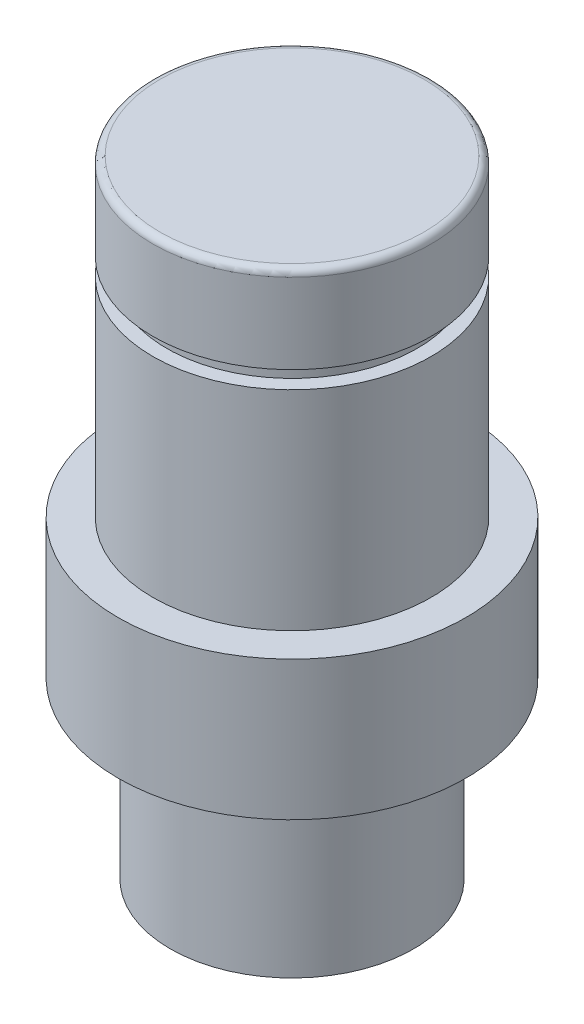
ISO-10303-21;
HEADER;
FILE_DESCRIPTION(('STEP AP214'),'2;1');
FILE_NAME('part.step','',(''),(''),'','','');
FILE_SCHEMA(('AUTOMOTIVE_DESIGN { 1 0 10303 214 1 1 1 1 }'));
ENDSEC;
DATA;
#1=APPLICATION_CONTEXT('core data for automotive mechanical design processes');
#2=APPLICATION_PROTOCOL_DEFINITION('international standard','automotive_design',2000,#1);
#3=PRODUCT_CONTEXT('',#1,'mechanical');
#4=PRODUCT('Part','Part','',(#3));
#5=PRODUCT_RELATED_PRODUCT_CATEGORY('part','',(#4));
#6=PRODUCT_DEFINITION_FORMATION('','',#4);
#7=PRODUCT_DEFINITION_CONTEXT('part definition',#1,'design');
#8=PRODUCT_DEFINITION('design','',#6,#7);
#9=PRODUCT_DEFINITION_SHAPE('','',#8);
#10=(LENGTH_UNIT() NAMED_UNIT(*) SI_UNIT(.MILLI.,.METRE.));
#11=(NAMED_UNIT(*) PLANE_ANGLE_UNIT() SI_UNIT($,.RADIAN.));
#12=(NAMED_UNIT(*) SI_UNIT($,.STERADIAN.) SOLID_ANGLE_UNIT());
#13=UNCERTAINTY_MEASURE_WITH_UNIT(LENGTH_MEASURE(1.E-05),#10,'distance_accuracy_value','');
#14=(GEOMETRIC_REPRESENTATION_CONTEXT(3) GLOBAL_UNCERTAINTY_ASSIGNED_CONTEXT((#13)) GLOBAL_UNIT_ASSIGNED_CONTEXT((#10,
#11,#12)) REPRESENTATION_CONTEXT('',''));
#15=CARTESIAN_POINT('',(0.,0.,0.));
#16=DIRECTION('',(0.,0.,1.));
#17=DIRECTION('',(1.,0.,0.));
#18=AXIS2_PLACEMENT_3D('',#15,#16,#17);
#19=CARTESIAN_POINT('',(0.054847899520899,-6.80459770114942,0.));
#20=DIRECTION('',(0.,-1.,0.));
#21=DIRECTION('',(0.,0.,-1.));
#22=AXIS2_PLACEMENT_3D('',#19,#20,#21);
#23=CYLINDRICAL_SURFACE('',#22,4.);
#24=CARTESIAN_POINT('',(0.054847899520899,2.19540229885058,0.));
#25=DIRECTION('',(0.,-1.,0.));
#26=DIRECTION('',(0.,0.,-1.));
#27=AXIS2_PLACEMENT_3D('',#24,#25,#26);
#28=CIRCLE('',#27,4.);
#29=CARTESIAN_POINT('',(0.054847899520899,2.19540229885058,-4.));
#30=VERTEX_POINT('',#29);
#31=EDGE_CURVE('E69',#30,#30,#28,.T.);
#32=ORIENTED_EDGE('',*,*,#31,.F.);
#33=EDGE_LOOP('',(#32));
#34=FACE_BOUND('',#33,.T.);
#35=CARTESIAN_POINT('',(0.054847899520899,8.19540229885058,0.));
#36=DIRECTION('',(0.,-1.,0.));
#37=DIRECTION('',(0.,0.,-1.));
#38=AXIS2_PLACEMENT_3D('',#35,#36,#37);
#39=CIRCLE('',#38,4.);
#40=CARTESIAN_POINT('',(0.054847899520899,8.19540229885058,-4.));
#41=VERTEX_POINT('',#40);
#42=EDGE_CURVE('E42',#41,#41,#39,.T.);
#43=ORIENTED_EDGE('',*,*,#42,.T.);
#44=EDGE_LOOP('',(#43));
#45=FACE_BOUND('',#44,.T.);
#46=ADVANCED_FACE('F31',(#34,#45),#23,.T.);
#47=CARTESIAN_POINT('',(-3.9451521004791,8.19540229885058,0.));
#48=DIRECTION('',(0.,-1.,0.));
#49=DIRECTION('',(0.,0.,-1.));
#50=AXIS2_PLACEMENT_3D('',#47,#48,#49);
#51=PLANE('',#50);
#52=ORIENTED_EDGE('',*,*,#42,.F.);
#53=EDGE_LOOP('',(#52));
#54=FACE_BOUND('',#53,.T.);
#55=CARTESIAN_POINT('',(0.054847899520899,8.19540229885058,0.));
#56=DIRECTION('',(0.,-1.,0.));
#57=DIRECTION('',(0.,0.,-1.));
#58=AXIS2_PLACEMENT_3D('',#55,#56,#57);
#59=CIRCLE('',#58,3.6);
#60=CARTESIAN_POINT('',(0.054847899520899,8.19540229885058,-3.6));
#61=VERTEX_POINT('',#60);
#62=EDGE_CURVE('E46',#61,#61,#59,.T.);
#63=ORIENTED_EDGE('',*,*,#62,.T.);
#64=EDGE_LOOP('',(#63));
#65=FACE_BOUND('',#64,.T.);
#66=ADVANCED_FACE('F77',(#54,#65),#51,.F.);
#67=CARTESIAN_POINT('',(0.054847899520899,-6.80459770114942,0.));
#68=DIRECTION('',(0.,-1.,0.));
#69=DIRECTION('',(0.,0.,-1.));
#70=AXIS2_PLACEMENT_3D('',#67,#68,#69);
#71=CYLINDRICAL_SURFACE('',#70,3.6);
#72=ORIENTED_EDGE('',*,*,#62,.F.);
#73=EDGE_LOOP('',(#72));
#74=FACE_BOUND('',#73,.T.);
#75=CARTESIAN_POINT('',(0.054847899520899,8.69540229885058,0.));
#76=DIRECTION('',(0.,-1.,0.));
#77=DIRECTION('',(0.,0.,-1.));
#78=AXIS2_PLACEMENT_3D('',#75,#76,#77);
#79=CIRCLE('',#78,3.6);
#80=CARTESIAN_POINT('',(0.054847899520899,8.69540229885058,-3.6));
#81=VERTEX_POINT('',#80);
#82=EDGE_CURVE('E51',#81,#81,#79,.T.);
#83=ORIENTED_EDGE('',*,*,#82,.T.);
#84=EDGE_LOOP('',(#83));
#85=FACE_BOUND('',#84,.T.);
#86=ADVANCED_FACE('F82',(#74,#85),#71,.T.);
#87=CARTESIAN_POINT('',(-3.5451521004791,8.69540229885058,0.));
#88=DIRECTION('',(0.,1.,0.));
#89=DIRECTION('',(0.,0.,1.));
#90=AXIS2_PLACEMENT_3D('',#87,#88,#89);
#91=PLANE('',#90);
#92=ORIENTED_EDGE('',*,*,#82,.F.);
#93=EDGE_LOOP('',(#92));
#94=FACE_BOUND('',#93,.T.);
#95=CARTESIAN_POINT('',(0.054847899520899,8.69540229885058,0.));
#96=DIRECTION('',(0.,-1.,0.));
#97=DIRECTION('',(0.,0.,-1.));
#98=AXIS2_PLACEMENT_3D('',#95,#96,#97);
#99=CIRCLE('',#98,4.);
#100=CARTESIAN_POINT('',(0.054847899520899,8.69540229885058,-4.));
#101=VERTEX_POINT('',#100);
#102=EDGE_CURVE('E54',#101,#101,#99,.T.);
#103=ORIENTED_EDGE('',*,*,#102,.T.);
#104=EDGE_LOOP('',(#103));
#105=FACE_BOUND('',#104,.T.);
#106=ADVANCED_FACE('F88',(#94,#105),#91,.F.);
#107=CARTESIAN_POINT('',(0.054847899520899,-6.80459770114942,0.));
#108=DIRECTION('',(0.,-1.,0.));
#109=DIRECTION('',(0.,0.,-1.));
#110=AXIS2_PLACEMENT_3D('',#107,#108,#109);
#111=CYLINDRICAL_SURFACE('',#110,4.);
#112=CARTESIAN_POINT('',(0.054847899520899,10.9954022988506,0.));
#113=DIRECTION('',(0.,-1.,0.));
#114=DIRECTION('',(0.,0.,-1.));
#115=AXIS2_PLACEMENT_3D('',#112,#113,#114);
#116=CIRCLE('',#115,4.);
#117=CARTESIAN_POINT('',(0.054847899520899,10.9954022988506,-4.));
#118=VERTEX_POINT('',#117);
#119=EDGE_CURVE('E38',#118,#118,#116,.T.);
#120=ORIENTED_EDGE('',*,*,#119,.T.);
#121=EDGE_LOOP('',(#120));
#122=FACE_BOUND('',#121,.T.);
#123=ORIENTED_EDGE('',*,*,#102,.F.);
#124=EDGE_LOOP('',(#123));
#125=FACE_BOUND('',#124,.T.);
#126=ADVANCED_FACE('F94',(#122,#125),#111,.T.);
#127=CARTESIAN_POINT('',(-3.9451521004791,11.1954022988506,0.));
#128=DIRECTION('',(0.,-1.,0.));
#129=DIRECTION('',(0.,0.,-1.));
#130=AXIS2_PLACEMENT_3D('',#127,#128,#129);
#131=PLANE('',#130);
#132=CARTESIAN_POINT('',(0.054847899520899,11.1954022988506,0.));
#133=DIRECTION('',(0.,-1.,0.));
#134=DIRECTION('',(0.,0.,-1.));
#135=AXIS2_PLACEMENT_3D('',#132,#133,#134);
#136=CIRCLE('',#135,3.8);
#137=CARTESIAN_POINT('',(0.054847899520899,11.1954022988506,-3.8));
#138=VERTEX_POINT('',#137);
#139=EDGE_CURVE('E10',#138,#138,#136,.F.);
#140=ORIENTED_EDGE('',*,*,#139,.T.);
#141=EDGE_LOOP('',(#140));
#142=FACE_BOUND('',#141,.T.);
#143=ADVANCED_FACE('F99',(#142),#131,.F.);
#144=CARTESIAN_POINT('',(-3.4451521004791,-6.80459770114942,0.));
#145=DIRECTION('',(0.,1.,0.));
#146=DIRECTION('',(0.,0.,1.));
#147=AXIS2_PLACEMENT_3D('',#144,#145,#146);
#148=PLANE('',#147);
#149=CARTESIAN_POINT('',(0.054847899520899,-6.80459770114942,0.));
#150=DIRECTION('',(0.,-1.,0.));
#151=DIRECTION('',(0.,0.,-1.));
#152=AXIS2_PLACEMENT_3D('',#149,#150,#151);
#153=CIRCLE('',#152,3.5);
#154=CARTESIAN_POINT('',(0.054847899520899,-6.80459770114942,-3.5));
#155=VERTEX_POINT('',#154);
#156=EDGE_CURVE('E57',#155,#155,#153,.T.);
#157=ORIENTED_EDGE('',*,*,#156,.T.);
#158=EDGE_LOOP('',(#157));
#159=FACE_BOUND('',#158,.T.);
#160=ADVANCED_FACE('F104',(#159),#148,.F.);
#161=CARTESIAN_POINT('',(0.054847899520899,-6.80459770114942,0.));
#162=DIRECTION('',(0.,-1.,0.));
#163=DIRECTION('',(0.,0.,-1.));
#164=AXIS2_PLACEMENT_3D('',#161,#162,#163);
#165=CYLINDRICAL_SURFACE('',#164,3.5);
#166=ORIENTED_EDGE('',*,*,#156,.F.);
#167=EDGE_LOOP('',(#166));
#168=FACE_BOUND('',#167,.T.);
#169=CARTESIAN_POINT('',(0.054847899520899,-1.80459770114942,0.));
#170=DIRECTION('',(0.,-1.,0.));
#171=DIRECTION('',(0.,0.,-1.));
#172=AXIS2_PLACEMENT_3D('',#169,#170,#171);
#173=CIRCLE('',#172,3.5);
#174=CARTESIAN_POINT('',(0.054847899520899,-1.80459770114942,-3.5));
#175=VERTEX_POINT('',#174);
#176=EDGE_CURVE('E60',#175,#175,#173,.T.);
#177=ORIENTED_EDGE('',*,*,#176,.T.);
#178=EDGE_LOOP('',(#177));
#179=FACE_BOUND('',#178,.T.);
#180=ADVANCED_FACE('F109',(#168,#179),#165,.T.);
#181=CARTESIAN_POINT('',(-4.9451521004791,-1.80459770114942,0.));
#182=DIRECTION('',(0.,1.,0.));
#183=DIRECTION('',(0.,0.,1.));
#184=AXIS2_PLACEMENT_3D('',#181,#182,#183);
#185=PLANE('',#184);
#186=ORIENTED_EDGE('',*,*,#176,.F.);
#187=EDGE_LOOP('',(#186));
#188=FACE_BOUND('',#187,.T.);
#189=CARTESIAN_POINT('',(0.054847899520899,-1.80459770114942,0.));
#190=DIRECTION('',(0.,-1.,0.));
#191=DIRECTION('',(0.,0.,-1.));
#192=AXIS2_PLACEMENT_3D('',#189,#190,#191);
#193=CIRCLE('',#192,5.);
#194=CARTESIAN_POINT('',(0.054847899520899,-1.80459770114942,-5.));
#195=VERTEX_POINT('',#194);
#196=EDGE_CURVE('E63',#195,#195,#193,.T.);
#197=ORIENTED_EDGE('',*,*,#196,.T.);
#198=EDGE_LOOP('',(#197));
#199=FACE_BOUND('',#198,.T.);
#200=ADVANCED_FACE('F113',(#188,#199),#185,.F.);
#201=CARTESIAN_POINT('',(0.054847899520899,-6.80459770114942,0.));
#202=DIRECTION('',(0.,-1.,0.));
#203=DIRECTION('',(0.,0.,-1.));
#204=AXIS2_PLACEMENT_3D('',#201,#202,#203);
#205=CYLINDRICAL_SURFACE('',#204,5.);
#206=ORIENTED_EDGE('',*,*,#196,.F.);
#207=EDGE_LOOP('',(#206));
#208=FACE_BOUND('',#207,.T.);
#209=CARTESIAN_POINT('',(0.054847899520899,2.19540229885058,0.));
#210=DIRECTION('',(0.,-1.,0.));
#211=DIRECTION('',(0.,0.,-1.));
#212=AXIS2_PLACEMENT_3D('',#209,#210,#211);
#213=CIRCLE('',#212,5.);
#214=CARTESIAN_POINT('',(0.054847899520899,2.19540229885058,-5.));
#215=VERTEX_POINT('',#214);
#216=EDGE_CURVE('E66',#215,#215,#213,.T.);
#217=ORIENTED_EDGE('',*,*,#216,.T.);
#218=EDGE_LOOP('',(#217));
#219=FACE_BOUND('',#218,.T.);
#220=ADVANCED_FACE('F117',(#208,#219),#205,.T.);
#221=CARTESIAN_POINT('',(-3.9451521004791,2.19540229885058,0.));
#222=DIRECTION('',(0.,-1.,0.));
#223=DIRECTION('',(0.,0.,-1.));
#224=AXIS2_PLACEMENT_3D('',#221,#222,#223);
#225=PLANE('',#224);
#226=ORIENTED_EDGE('',*,*,#216,.F.);
#227=EDGE_LOOP('',(#226));
#228=FACE_BOUND('',#227,.T.);
#229=ORIENTED_EDGE('',*,*,#31,.T.);
#230=EDGE_LOOP('',(#229));
#231=FACE_BOUND('',#230,.T.);
#232=ADVANCED_FACE('F73',(#228,#231),#225,.F.);
#233=CARTESIAN_POINT('',(0.054847899520899,10.9954022988506,0.));
#234=DIRECTION('',(0.,-1.,0.));
#235=DIRECTION('',(0.,0.,-1.));
#236=AXIS2_PLACEMENT_3D('',#233,#234,#235);
#237=TOROIDAL_SURFACE('',#236,3.8,0.2);
#238=ORIENTED_EDGE('',*,*,#139,.F.);
#239=EDGE_LOOP('',(#238));
#240=FACE_BOUND('',#239,.T.);
#241=ORIENTED_EDGE('',*,*,#119,.F.);
#242=EDGE_LOOP('',(#241));
#243=FACE_BOUND('',#242,.T.);
#244=ADVANCED_FACE('F33',(#240,#243),#237,.T.);
#245=CLOSED_SHELL('',(#46,#66,#86,#106,#126,#143,#160,#180,#200,#220,#232,#244));
#246=MANIFOLD_SOLID_BREP('B2',#245);
#247=ADVANCED_BREP_SHAPE_REPRESENTATION('',(#18,#246),#14);
#248=SHAPE_DEFINITION_REPRESENTATION(#9,#247);
ENDSEC;
END-ISO-10303-21;
